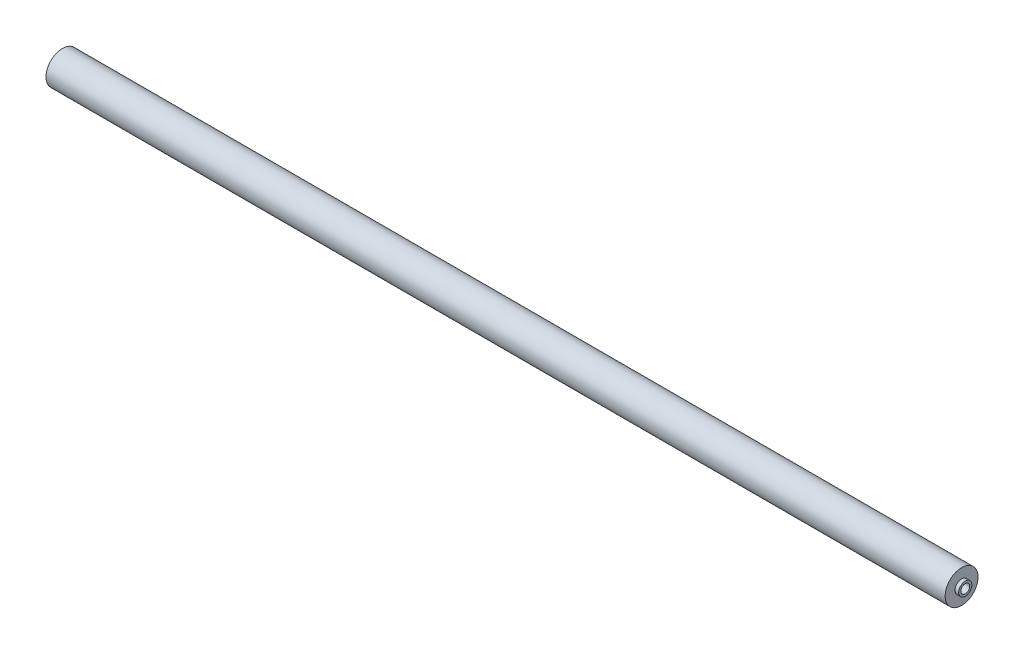
ISO-10303-21;
HEADER;
FILE_DESCRIPTION(('STEP AP214'),'2;1');
FILE_NAME('part.step','',(''),(''),'','','');
FILE_SCHEMA(('AUTOMOTIVE_DESIGN { 1 0 10303 214 1 1 1 1 }'));
ENDSEC;
DATA;
#1=APPLICATION_CONTEXT('core data for automotive mechanical design processes');
#2=APPLICATION_PROTOCOL_DEFINITION('international standard','automotive_design',2000,#1);
#3=PRODUCT_CONTEXT('',#1,'mechanical');
#4=PRODUCT('Part','Part','',(#3));
#5=PRODUCT_RELATED_PRODUCT_CATEGORY('part','',(#4));
#6=PRODUCT_DEFINITION_FORMATION('','',#4);
#7=PRODUCT_DEFINITION_CONTEXT('part definition',#1,'design');
#8=PRODUCT_DEFINITION('design','',#6,#7);
#9=PRODUCT_DEFINITION_SHAPE('','',#8);
#10=(LENGTH_UNIT() NAMED_UNIT(*) SI_UNIT(.MILLI.,.METRE.));
#11=(NAMED_UNIT(*) PLANE_ANGLE_UNIT() SI_UNIT($,.RADIAN.));
#12=(NAMED_UNIT(*) SI_UNIT($,.STERADIAN.) SOLID_ANGLE_UNIT());
#13=UNCERTAINTY_MEASURE_WITH_UNIT(LENGTH_MEASURE(1.E-05),#10,'distance_accuracy_value','');
#14=(GEOMETRIC_REPRESENTATION_CONTEXT(3) GLOBAL_UNCERTAINTY_ASSIGNED_CONTEXT((#13)) GLOBAL_UNIT_ASSIGNED_CONTEXT((#10,
#11,#12)) REPRESENTATION_CONTEXT('',''));
#15=CARTESIAN_POINT('',(0.,0.,0.));
#16=DIRECTION('',(0.,0.,1.));
#17=DIRECTION('',(1.,0.,0.));
#18=AXIS2_PLACEMENT_3D('',#15,#16,#17);
#19=CARTESIAN_POINT('',(-610.1,134.859540351136,0.));
#20=DIRECTION('',(1.,0.,0.));
#21=DIRECTION('',(0.,0.,-1.));
#22=AXIS2_PLACEMENT_3D('',#19,#20,#21);
#23=PLANE('',#22);
#24=CARTESIAN_POINT('',(-610.1,125.334540351136,0.));
#25=DIRECTION('',(-1.,0.,0.));
#26=DIRECTION('',(0.,0.,1.));
#27=AXIS2_PLACEMENT_3D('',#24,#25,#26);
#28=CIRCLE('',#27,4.56187038952058);
#29=CARTESIAN_POINT('',(-610.1,125.334540351136,4.56187038952058));
#30=VERTEX_POINT('',#29);
#31=EDGE_CURVE('E114',#30,#30,#28,.T.);
#32=ORIENTED_EDGE('',*,*,#31,.F.);
#33=EDGE_LOOP('',(#32));
#34=FACE_BOUND('',#33,.T.);
#35=CARTESIAN_POINT('',(-610.1,125.334540351136,0.));
#36=DIRECTION('',(-1.,0.,0.));
#37=DIRECTION('',(0.,0.,1.));
#38=AXIS2_PLACEMENT_3D('',#35,#36,#37);
#39=CIRCLE('',#38,9.52500000000003);
#40=CARTESIAN_POINT('',(-610.1,125.334540351136,9.52500000000003));
#41=VERTEX_POINT('',#40);
#42=EDGE_CURVE('E11',#41,#41,#39,.T.);
#43=ORIENTED_EDGE('',*,*,#42,.T.);
#44=EDGE_LOOP('',(#43));
#45=FACE_BOUND('',#44,.T.);
#46=ADVANCED_FACE('F31',(#34,#45),#23,.F.);
#47=CARTESIAN_POINT('',(-669.436923844671,125.334540351136,0.));
#48=DIRECTION('',(-1.,0.,0.));
#49=DIRECTION('',(0.,0.,1.));
#50=AXIS2_PLACEMENT_3D('',#47,#48,#49);
#51=CYLINDRICAL_SURFACE('',#50,9.52500000000002);
#52=ORIENTED_EDGE('',*,*,#42,.F.);
#53=EDGE_LOOP('',(#52));
#54=FACE_BOUND('',#53,.T.);
#55=CARTESIAN_POINT('',(-88.9,125.334540351136,0.));
#56=DIRECTION('',(-1.,0.,0.));
#57=DIRECTION('',(0.,0.,1.));
#58=AXIS2_PLACEMENT_3D('',#55,#56,#57);
#59=CIRCLE('',#58,9.52500000000001);
#60=CARTESIAN_POINT('',(-88.9,125.334540351136,9.52500000000001));
#61=VERTEX_POINT('',#60);
#62=EDGE_CURVE('E38',#61,#61,#59,.T.);
#63=ORIENTED_EDGE('',*,*,#62,.T.);
#64=EDGE_LOOP('',(#63));
#65=FACE_BOUND('',#64,.T.);
#66=ADVANCED_FACE('F75',(#54,#65),#51,.T.);
#67=CARTESIAN_POINT('',(-88.8999999999999,134.859540351136,0.));
#68=DIRECTION('',(-1.,0.,0.));
#69=DIRECTION('',(0.,0.,1.));
#70=AXIS2_PLACEMENT_3D('',#67,#68,#69);
#71=PLANE('',#70);
#72=ORIENTED_EDGE('',*,*,#62,.F.);
#73=EDGE_LOOP('',(#72));
#74=FACE_BOUND('',#73,.T.);
#75=CARTESIAN_POINT('',(-88.9,125.334540351136,0.));
#76=DIRECTION('',(-1.,0.,0.));
#77=DIRECTION('',(0.,0.,1.));
#78=AXIS2_PLACEMENT_3D('',#75,#76,#77);
#79=CIRCLE('',#78,3.82166881173637);
#80=CARTESIAN_POINT('',(-88.9,125.334540351136,3.82166881173637));
#81=VERTEX_POINT('',#80);
#82=EDGE_CURVE('E70',#81,#81,#79,.T.);
#83=ORIENTED_EDGE('',*,*,#82,.T.);
#84=EDGE_LOOP('',(#83));
#85=FACE_BOUND('',#84,.T.);
#86=ADVANCED_FACE('F77',(#74,#85),#71,.F.);
#87=CARTESIAN_POINT('',(-669.436923844671,125.334540351136,0.));
#88=DIRECTION('',(-1.,0.,0.));
#89=DIRECTION('',(0.,0.,1.));
#90=AXIS2_PLACEMENT_3D('',#87,#88,#89);
#91=CYLINDRICAL_SURFACE('',#90,3.82166881173637);
#92=ORIENTED_EDGE('',*,*,#82,.F.);
#93=EDGE_LOOP('',(#92));
#94=FACE_BOUND('',#93,.T.);
#95=CARTESIAN_POINT('',(-86.7667228234836,125.334540351136,0.));
#96=DIRECTION('',(-1.,0.,0.));
#97=DIRECTION('',(0.,0.,1.));
#98=AXIS2_PLACEMENT_3D('',#95,#96,#97);
#99=CIRCLE('',#98,3.82166881173637);
#100=CARTESIAN_POINT('',(-86.7667228234836,125.334540351136,3.82166881173637));
#101=VERTEX_POINT('',#100);
#102=EDGE_CURVE('E67',#101,#101,#99,.T.);
#103=ORIENTED_EDGE('',*,*,#102,.T.);
#104=EDGE_LOOP('',(#103));
#105=FACE_BOUND('',#104,.T.);
#106=ADVANCED_FACE('F80',(#94,#105),#91,.T.);
#107=CARTESIAN_POINT('',(-86.7667228234836,129.156209162872,0.));
#108=DIRECTION('',(-1.,0.,0.));
#109=DIRECTION('',(0.,0.,1.));
#110=AXIS2_PLACEMENT_3D('',#107,#108,#109);
#111=PLANE('',#110);
#112=ORIENTED_EDGE('',*,*,#102,.F.);
#113=EDGE_LOOP('',(#112));
#114=FACE_BOUND('',#113,.T.);
#115=CARTESIAN_POINT('',(-86.7667228234836,125.334540351136,0.));
#116=DIRECTION('',(-1.,0.,0.));
#117=DIRECTION('',(0.,0.,1.));
#118=AXIS2_PLACEMENT_3D('',#115,#116,#117);
#119=CIRCLE('',#118,2.57361127371544);
#120=CARTESIAN_POINT('',(-86.7667228234836,125.334540351136,2.57361127371544));
#121=VERTEX_POINT('',#120);
#122=EDGE_CURVE('E58',#121,#121,#119,.T.);
#123=ORIENTED_EDGE('',*,*,#122,.T.);
#124=EDGE_LOOP('',(#123));
#125=FACE_BOUND('',#124,.T.);
#126=ADVANCED_FACE('F86',(#114,#125),#111,.F.);
#127=CARTESIAN_POINT('',(-669.436923844671,125.334540351136,0.));
#128=DIRECTION('',(-1.,0.,0.));
#129=DIRECTION('',(0.,0.,1.));
#130=AXIS2_PLACEMENT_3D('',#127,#128,#129);
#131=CYLINDRICAL_SURFACE('',#130,2.57361127371544);
#132=ORIENTED_EDGE('',*,*,#122,.F.);
#133=EDGE_LOOP('',(#132));
#134=FACE_BOUND('',#133,.T.);
#135=CARTESIAN_POINT('',(-91.5380564772477,125.334540351136,0.));
#136=DIRECTION('',(-1.,0.,0.));
#137=DIRECTION('',(0.,0.,1.));
#138=AXIS2_PLACEMENT_3D('',#135,#136,#137);
#139=CIRCLE('',#138,2.57361127371544);
#140=CARTESIAN_POINT('',(-91.5380564772477,125.334540351136,2.57361127371544));
#141=VERTEX_POINT('',#140);
#142=EDGE_CURVE('E54',#141,#141,#139,.T.);
#143=ORIENTED_EDGE('',*,*,#142,.T.);
#144=EDGE_LOOP('',(#143));
#145=FACE_BOUND('',#144,.T.);
#146=ADVANCED_FACE('F92',(#134,#145),#131,.F.);
#147=CARTESIAN_POINT('',(-93.3610656563957,125.334540351136,0.));
#148=DIRECTION('',(1.,0.,0.));
#149=DIRECTION('',(0.,0.,-1.));
#150=AXIS2_PLACEMENT_3D('',#147,#148,#149);
#151=CONICAL_SURFACE('',#150,0.,0.954490455959782);
#152=ORIENTED_EDGE('',*,*,#142,.F.);
#153=EDGE_LOOP('',(#152));
#154=FACE_BOUND('',#153,.T.);
#155=CARTESIAN_POINT('',(-93.3610656563957,125.334540351136,0.));
#156=VERTEX_POINT('',#155);
#157=VERTEX_LOOP('',#156);
#158=FACE_BOUND('',#157,.T.);
#159=ADVANCED_FACE('F48',(#154,#158),#151,.F.);
#160=CARTESIAN_POINT('',(-605.901094644352,125.334540351136,0.));
#161=DIRECTION('',(-1.,0.,0.));
#162=DIRECTION('',(0.,0.,1.));
#163=AXIS2_PLACEMENT_3D('',#160,#161,#162);
#164=CONICAL_SURFACE('',#163,2.57361127371544,1.11369591507846);
#165=CARTESIAN_POINT('',(-604.635283007468,125.334540351136,0.));
#166=VERTEX_POINT('',#165);
#167=VERTEX_LOOP('',#166);
#168=FACE_BOUND('',#167,.T.);
#169=CARTESIAN_POINT('',(-605.901094644352,125.334540351136,0.));
#170=DIRECTION('',(-1.,0.,0.));
#171=DIRECTION('',(0.,0.,1.));
#172=AXIS2_PLACEMENT_3D('',#169,#170,#171);
#173=CIRCLE('',#172,2.57361127371544);
#174=CARTESIAN_POINT('',(-605.901094644352,125.334540351136,2.57361127371544));
#175=VERTEX_POINT('',#174);
#176=EDGE_CURVE('E52',#175,#175,#173,.T.);
#177=ORIENTED_EDGE('',*,*,#176,.T.);
#178=EDGE_LOOP('',(#177));
#179=FACE_BOUND('',#178,.T.);
#180=ADVANCED_FACE('F44',(#168,#179),#164,.F.);
#181=CARTESIAN_POINT('',(-669.436923844671,125.334540351136,0.));
#182=DIRECTION('',(-1.,0.,0.));
#183=DIRECTION('',(0.,0.,1.));
#184=AXIS2_PLACEMENT_3D('',#181,#182,#183);
#185=CYLINDRICAL_SURFACE('',#184,2.57361127371544);
#186=ORIENTED_EDGE('',*,*,#176,.F.);
#187=EDGE_LOOP('',(#186));
#188=FACE_BOUND('',#187,.T.);
#189=CARTESIAN_POINT('',(-612.957851499431,125.334540351136,0.));
#190=DIRECTION('',(-1.,0.,0.));
#191=DIRECTION('',(0.,0.,1.));
#192=AXIS2_PLACEMENT_3D('',#189,#190,#191);
#193=CIRCLE('',#192,2.57361127371544);
#194=CARTESIAN_POINT('',(-612.957851499431,125.334540351136,2.57361127371544));
#195=VERTEX_POINT('',#194);
#196=EDGE_CURVE('E55',#195,#195,#193,.T.);
#197=ORIENTED_EDGE('',*,*,#196,.T.);
#198=EDGE_LOOP('',(#197));
#199=FACE_BOUND('',#198,.T.);
#200=ADVANCED_FACE('F47',(#188,#199),#185,.F.);
#201=CARTESIAN_POINT('',(-612.957851499431,129.896410740656,0.));
#202=DIRECTION('',(1.,0.,0.));
#203=DIRECTION('',(0.,0.,-1.));
#204=AXIS2_PLACEMENT_3D('',#201,#202,#203);
#205=PLANE('',#204);
#206=ORIENTED_EDGE('',*,*,#196,.F.);
#207=EDGE_LOOP('',(#206));
#208=FACE_BOUND('',#207,.T.);
#209=CARTESIAN_POINT('',(-612.957851499431,125.334540351136,0.));
#210=DIRECTION('',(-1.,0.,0.));
#211=DIRECTION('',(0.,0.,1.));
#212=AXIS2_PLACEMENT_3D('',#209,#210,#211);
#213=CIRCLE('',#212,4.56187038952058);
#214=CARTESIAN_POINT('',(-612.957851499431,125.334540351136,4.56187038952058));
#215=VERTEX_POINT('',#214);
#216=EDGE_CURVE('E61',#215,#215,#213,.T.);
#217=ORIENTED_EDGE('',*,*,#216,.T.);
#218=EDGE_LOOP('',(#217));
#219=FACE_BOUND('',#218,.T.);
#220=ADVANCED_FACE('F121',(#208,#219),#205,.F.);
#221=CARTESIAN_POINT('',(-669.436923844671,125.334540351136,0.));
#222=DIRECTION('',(-1.,0.,0.));
#223=DIRECTION('',(0.,0.,1.));
#224=AXIS2_PLACEMENT_3D('',#221,#222,#223);
#225=CYLINDRICAL_SURFACE('',#224,4.56187038952058);
#226=ORIENTED_EDGE('',*,*,#216,.F.);
#227=EDGE_LOOP('',(#226));
#228=FACE_BOUND('',#227,.T.);
#229=ORIENTED_EDGE('',*,*,#31,.T.);
#230=EDGE_LOOP('',(#229));
#231=FACE_BOUND('',#230,.T.);
#232=ADVANCED_FACE('F123',(#228,#231),#225,.T.);
#233=CLOSED_SHELL('',(#46,#66,#86,#106,#126,#146,#159,#180,#200,#220,#232));
#234=MANIFOLD_SOLID_BREP('B2',#233);
#235=ADVANCED_BREP_SHAPE_REPRESENTATION('',(#18,#234),#14);
#236=SHAPE_DEFINITION_REPRESENTATION(#9,#235);
ENDSEC;
END-ISO-10303-21;
